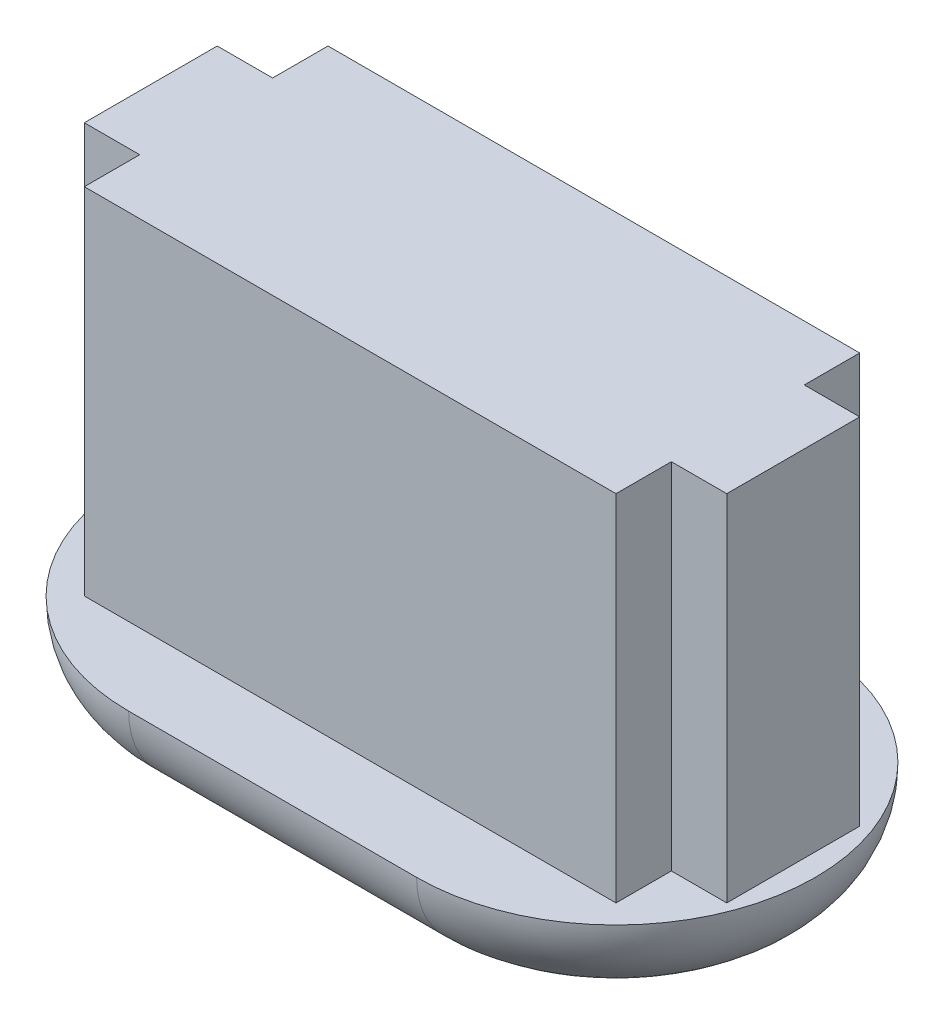
ISO-10303-21;
HEADER;
FILE_DESCRIPTION(('STEP AP214'),'2;1');
FILE_NAME('part.step','',(''),(''),'','','');
FILE_SCHEMA(('AUTOMOTIVE_DESIGN { 1 0 10303 214 1 1 1 1 }'));
ENDSEC;
DATA;
#1=APPLICATION_CONTEXT('core data for automotive mechanical design processes');
#2=APPLICATION_PROTOCOL_DEFINITION('international standard','automotive_design',2000,#1);
#3=PRODUCT_CONTEXT('',#1,'mechanical');
#4=PRODUCT('Part','Part','',(#3));
#5=PRODUCT_RELATED_PRODUCT_CATEGORY('part','',(#4));
#6=PRODUCT_DEFINITION_FORMATION('','',#4);
#7=PRODUCT_DEFINITION_CONTEXT('part definition',#1,'design');
#8=PRODUCT_DEFINITION('design','',#6,#7);
#9=PRODUCT_DEFINITION_SHAPE('','',#8);
#10=(LENGTH_UNIT() NAMED_UNIT(*) SI_UNIT(.MILLI.,.METRE.));
#11=(NAMED_UNIT(*) PLANE_ANGLE_UNIT() SI_UNIT($,.RADIAN.));
#12=(NAMED_UNIT(*) SI_UNIT($,.STERADIAN.) SOLID_ANGLE_UNIT());
#13=UNCERTAINTY_MEASURE_WITH_UNIT(LENGTH_MEASURE(1.E-05),#10,'distance_accuracy_value','');
#14=(GEOMETRIC_REPRESENTATION_CONTEXT(3) GLOBAL_UNCERTAINTY_ASSIGNED_CONTEXT((#13)) GLOBAL_UNIT_ASSIGNED_CONTEXT((#10,
#11,#12)) REPRESENTATION_CONTEXT('',''));
#15=CARTESIAN_POINT('',(0.,0.,0.));
#16=DIRECTION('',(0.,0.,1.));
#17=DIRECTION('',(1.,0.,0.));
#18=AXIS2_PLACEMENT_3D('',#15,#16,#17);
#19=CARTESIAN_POINT('',(0.,2.,0.));
#20=DIRECTION('',(0.,1.,0.));
#21=DIRECTION('',(0.,0.,1.));
#22=AXIS2_PLACEMENT_3D('',#19,#20,#21);
#23=PLANE('',#22);
#24=DIRECTION('',(1.,0.,0.));
#25=VECTOR('',#24,1.);
#26=CARTESIAN_POINT('',(0.,2.,-2.75));
#27=LINE('',#26,#25);
#28=CARTESIAN_POINT('',(-2.75,2.,-2.75));
#29=VERTEX_POINT('',#28);
#30=CARTESIAN_POINT('',(9.25,2.,-2.75));
#31=VERTEX_POINT('',#30);
#32=EDGE_CURVE('E217',#29,#31,#27,.T.);
#33=ORIENTED_EDGE('',*,*,#32,.T.);
#34=DIRECTION('',(0.,0.,-1.));
#35=VECTOR('',#34,1.);
#36=CARTESIAN_POINT('',(9.25,2.,0.));
#37=LINE('',#36,#35);
#38=CARTESIAN_POINT('',(9.25,2.,-1.5));
#39=VERTEX_POINT('',#38);
#40=EDGE_CURVE('E225',#39,#31,#37,.T.);
#41=ORIENTED_EDGE('',*,*,#40,.F.);
#42=DIRECTION('',(-1.,0.,0.));
#43=VECTOR('',#42,1.);
#44=CARTESIAN_POINT('',(0.,2.,-1.5));
#45=LINE('',#44,#43);
#46=CARTESIAN_POINT('',(10.5,2.,-1.5));
#47=VERTEX_POINT('',#46);
#48=EDGE_CURVE('E274',#47,#39,#45,.T.);
#49=ORIENTED_EDGE('',*,*,#48,.F.);
#50=DIRECTION('',(0.,0.,-1.));
#51=VECTOR('',#50,1.);
#52=CARTESIAN_POINT('',(10.5,2.,0.));
#53=LINE('',#52,#51);
#54=CARTESIAN_POINT('',(10.5,2.,1.5));
#55=VERTEX_POINT('',#54);
#56=EDGE_CURVE('E272',#55,#47,#53,.T.);
#57=ORIENTED_EDGE('',*,*,#56,.F.);
#58=DIRECTION('',(-1.,0.,0.));
#59=VECTOR('',#58,1.);
#60=CARTESIAN_POINT('',(0.,2.,1.50000000000001));
#61=LINE('',#60,#59);
#62=CARTESIAN_POINT('',(9.25,2.,1.5));
#63=VERTEX_POINT('',#62);
#64=EDGE_CURVE('E269',#55,#63,#61,.T.);
#65=ORIENTED_EDGE('',*,*,#64,.T.);
#66=CARTESIAN_POINT('',(9.25,2.,2.75));
#67=VERTEX_POINT('',#66);
#68=EDGE_CURVE('E266',#67,#63,#37,.T.);
#69=ORIENTED_EDGE('',*,*,#68,.F.);
#70=DIRECTION('',(1.,0.,0.));
#71=VECTOR('',#70,1.);
#72=CARTESIAN_POINT('',(0.,2.,2.75));
#73=LINE('',#72,#71);
#74=CARTESIAN_POINT('',(-2.75,2.,2.75));
#75=VERTEX_POINT('',#74);
#76=EDGE_CURVE('E264',#75,#67,#73,.T.);
#77=ORIENTED_EDGE('',*,*,#76,.F.);
#78=DIRECTION('',(0.,0.,-1.));
#79=VECTOR('',#78,1.);
#80=CARTESIAN_POINT('',(-2.75,2.,0.));
#81=LINE('',#80,#79);
#82=CARTESIAN_POINT('',(-2.75,2.,1.5));
#83=VERTEX_POINT('',#82);
#84=EDGE_CURVE('E255',#75,#83,#81,.T.);
#85=ORIENTED_EDGE('',*,*,#84,.T.);
#86=DIRECTION('',(1.,0.,0.));
#87=VECTOR('',#86,1.);
#88=CARTESIAN_POINT('',(0.,2.,1.5));
#89=LINE('',#88,#87);
#90=CARTESIAN_POINT('',(-4.,2.,1.5));
#91=VERTEX_POINT('',#90);
#92=EDGE_CURVE('E261',#91,#83,#89,.T.);
#93=ORIENTED_EDGE('',*,*,#92,.F.);
#94=DIRECTION('',(0.,0.,-1.));
#95=VECTOR('',#94,1.);
#96=CARTESIAN_POINT('',(-4.,2.,0.));
#97=LINE('',#96,#95);
#98=CARTESIAN_POINT('',(-4.,2.,-1.5));
#99=VERTEX_POINT('',#98);
#100=EDGE_CURVE('E258',#91,#99,#97,.T.);
#101=ORIENTED_EDGE('',*,*,#100,.T.);
#102=DIRECTION('',(1.,0.,0.));
#103=VECTOR('',#102,1.);
#104=CARTESIAN_POINT('',(0.,2.,-1.5));
#105=LINE('',#104,#103);
#106=CARTESIAN_POINT('',(-2.75,2.,-1.5));
#107=VERTEX_POINT('',#106);
#108=EDGE_CURVE('E254',#99,#107,#105,.T.);
#109=ORIENTED_EDGE('',*,*,#108,.T.);
#110=EDGE_CURVE('E251',#107,#29,#81,.T.);
#111=ORIENTED_EDGE('',*,*,#110,.T.);
#112=EDGE_LOOP('',(#33,#41,#49,#57,#65,#69,#77,#85,#93,#101,#109,#111));
#113=FACE_BOUND('',#112,.T.);
#114=CARTESIAN_POINT('',(0.,2.,0.));
#115=DIRECTION('',(0.,1.,0.));
#116=DIRECTION('',(0.,0.,1.));
#117=AXIS2_PLACEMENT_3D('',#114,#115,#116);
#118=CIRCLE('',#117,4.5);
#119=CARTESIAN_POINT('',(0.,2.,-4.5));
#120=VERTEX_POINT('',#119);
#121=CARTESIAN_POINT('',(0.,2.,4.5));
#122=VERTEX_POINT('',#121);
#123=EDGE_CURVE('E302',#120,#122,#118,.T.);
#124=ORIENTED_EDGE('',*,*,#123,.T.);
#125=DIRECTION('',(1.,0.,0.));
#126=VECTOR('',#125,1.);
#127=CARTESIAN_POINT('',(0.,2.,4.5));
#128=LINE('',#127,#126);
#129=CARTESIAN_POINT('',(6.5,2.,4.5));
#130=VERTEX_POINT('',#129);
#131=EDGE_CURVE('E304',#122,#130,#128,.T.);
#132=ORIENTED_EDGE('',*,*,#131,.T.);
#133=CARTESIAN_POINT('',(6.5,2.,0.));
#134=DIRECTION('',(0.,1.,0.));
#135=DIRECTION('',(0.,0.,1.));
#136=AXIS2_PLACEMENT_3D('',#133,#134,#135);
#137=CIRCLE('',#136,4.5);
#138=CARTESIAN_POINT('',(6.5,2.,-4.5));
#139=VERTEX_POINT('',#138);
#140=EDGE_CURVE('E306',#130,#139,#137,.T.);
#141=ORIENTED_EDGE('',*,*,#140,.T.);
#142=DIRECTION('',(-1.,0.,0.));
#143=VECTOR('',#142,1.);
#144=CARTESIAN_POINT('',(0.,2.,-4.5));
#145=LINE('',#144,#143);
#146=EDGE_CURVE('E308',#139,#120,#145,.T.);
#147=ORIENTED_EDGE('',*,*,#146,.T.);
#148=EDGE_LOOP('',(#124,#132,#141,#147));
#149=FACE_BOUND('',#148,.T.);
#150=ADVANCED_FACE('F41',(#113,#149),#23,.T.);
#151=CARTESIAN_POINT('',(0.,0.,0.));
#152=DIRECTION('',(0.,1.,0.));
#153=DIRECTION('',(0.,0.,1.));
#154=AXIS2_PLACEMENT_3D('',#151,#152,#153);
#155=PLANE('',#154);
#156=DIRECTION('',(-1.,0.,0.));
#157=VECTOR('',#156,1.);
#158=CARTESIAN_POINT('',(6.5,0.,1.5));
#159=LINE('',#158,#157);
#160=CARTESIAN_POINT('',(6.5,0.,1.5));
#161=VERTEX_POINT('',#160);
#162=CARTESIAN_POINT('',(0.,0.,1.5));
#163=VERTEX_POINT('',#162);
#164=EDGE_CURVE('E211',#161,#163,#159,.T.);
#165=ORIENTED_EDGE('',*,*,#164,.F.);
#166=CARTESIAN_POINT('',(6.5,0.,0.));
#167=DIRECTION('',(0.,-1.,0.));
#168=DIRECTION('',(0.,0.,-1.));
#169=AXIS2_PLACEMENT_3D('',#166,#167,#168);
#170=CIRCLE('',#169,1.5);
#171=CARTESIAN_POINT('',(6.5,0.,-1.5));
#172=VERTEX_POINT('',#171);
#173=EDGE_CURVE('E58',#172,#161,#170,.T.);
#174=ORIENTED_EDGE('',*,*,#173,.F.);
#175=DIRECTION('',(1.,0.,0.));
#176=VECTOR('',#175,1.);
#177=CARTESIAN_POINT('',(0.,0.,-1.5));
#178=LINE('',#177,#176);
#179=CARTESIAN_POINT('',(0.,0.,-1.5));
#180=VERTEX_POINT('',#179);
#181=EDGE_CURVE('E202',#180,#172,#178,.T.);
#182=ORIENTED_EDGE('',*,*,#181,.F.);
#183=CARTESIAN_POINT('',(0.,0.,0.));
#184=DIRECTION('',(0.,-1.,0.));
#185=DIRECTION('',(0.,0.,-1.));
#186=AXIS2_PLACEMENT_3D('',#183,#184,#185);
#187=CIRCLE('',#186,1.5);
#188=EDGE_CURVE('E205',#163,#180,#187,.T.);
#189=ORIENTED_EDGE('',*,*,#188,.F.);
#190=EDGE_LOOP('',(#165,#174,#182,#189));
#191=FACE_BOUND('',#190,.T.);
#192=CARTESIAN_POINT('',(0.,0.,0.));
#193=DIRECTION('',(0.,1.,0.));
#194=DIRECTION('',(0.,0.,1.));
#195=AXIS2_PLACEMENT_3D('',#192,#193,#194);
#196=CIRCLE('',#195,2.5);
#197=CARTESIAN_POINT('',(0.,0.,2.5));
#198=VERTEX_POINT('',#197);
#199=CARTESIAN_POINT('',(0.,0.,-2.5));
#200=VERTEX_POINT('',#199);
#201=EDGE_CURVE('E313',#198,#200,#196,.F.);
#202=ORIENTED_EDGE('',*,*,#201,.T.);
#203=DIRECTION('',(-1.,0.,0.));
#204=VECTOR('',#203,1.);
#205=CARTESIAN_POINT('',(0.,0.,-2.5));
#206=LINE('',#205,#204);
#207=CARTESIAN_POINT('',(6.5,0.,-2.5));
#208=VERTEX_POINT('',#207);
#209=EDGE_CURVE('E11',#200,#208,#206,.F.);
#210=ORIENTED_EDGE('',*,*,#209,.T.);
#211=CARTESIAN_POINT('',(6.5,0.,0.));
#212=DIRECTION('',(0.,1.,0.));
#213=DIRECTION('',(0.,0.,1.));
#214=AXIS2_PLACEMENT_3D('',#211,#212,#213);
#215=CIRCLE('',#214,2.5);
#216=CARTESIAN_POINT('',(6.5,0.,2.5));
#217=VERTEX_POINT('',#216);
#218=EDGE_CURVE('E50',#208,#217,#215,.F.);
#219=ORIENTED_EDGE('',*,*,#218,.T.);
#220=DIRECTION('',(1.,0.,0.));
#221=VECTOR('',#220,1.);
#222=CARTESIAN_POINT('',(0.,0.,2.5));
#223=LINE('',#222,#221);
#224=EDGE_CURVE('E311',#217,#198,#223,.F.);
#225=ORIENTED_EDGE('',*,*,#224,.T.);
#226=EDGE_LOOP('',(#202,#210,#219,#225));
#227=FACE_BOUND('',#226,.T.);
#228=ADVANCED_FACE('F335',(#191,#227),#155,.F.);
#229=CARTESIAN_POINT('',(0.,2.,2.5));
#230=DIRECTION('',(1.,0.,0.));
#231=DIRECTION('',(0.,0.,-1.));
#232=AXIS2_PLACEMENT_3D('',#229,#230,#231);
#233=CYLINDRICAL_SURFACE('',#232,2.);
#234=CARTESIAN_POINT('',(0.,2.,2.5));
#235=DIRECTION('',(-1.,0.,0.));
#236=DIRECTION('',(0.,0.,1.));
#237=AXIS2_PLACEMENT_3D('',#234,#235,#236);
#238=CIRCLE('',#237,2.);
#239=EDGE_CURVE('E318',#198,#122,#238,.T.);
#240=ORIENTED_EDGE('',*,*,#239,.F.);
#241=ORIENTED_EDGE('',*,*,#224,.F.);
#242=CARTESIAN_POINT('',(6.5,2.,2.5));
#243=DIRECTION('',(1.,0.,0.));
#244=DIRECTION('',(0.,0.,-1.));
#245=AXIS2_PLACEMENT_3D('',#242,#243,#244);
#246=CIRCLE('',#245,2.);
#247=EDGE_CURVE('E45',#130,#217,#246,.T.);
#248=ORIENTED_EDGE('',*,*,#247,.F.);
#249=ORIENTED_EDGE('',*,*,#131,.F.);
#250=EDGE_LOOP('',(#240,#241,#248,#249));
#251=FACE_BOUND('',#250,.T.);
#252=ADVANCED_FACE('F43',(#251),#233,.T.);
#253=CARTESIAN_POINT('',(6.5,2.,0.));
#254=DIRECTION('',(0.,1.,0.));
#255=DIRECTION('',(0.,0.,1.));
#256=AXIS2_PLACEMENT_3D('',#253,#254,#255);
#257=TOROIDAL_SURFACE('',#256,2.5,2.);
#258=ORIENTED_EDGE('',*,*,#247,.T.);
#259=ORIENTED_EDGE('',*,*,#218,.F.);
#260=CARTESIAN_POINT('',(6.5,2.,-2.5));
#261=DIRECTION('',(-1.,0.,0.));
#262=DIRECTION('',(0.,0.,1.));
#263=AXIS2_PLACEMENT_3D('',#260,#261,#262);
#264=CIRCLE('',#263,2.);
#265=EDGE_CURVE('E317',#139,#208,#264,.T.);
#266=ORIENTED_EDGE('',*,*,#265,.F.);
#267=ORIENTED_EDGE('',*,*,#140,.F.);
#268=EDGE_LOOP('',(#258,#259,#266,#267));
#269=FACE_BOUND('',#268,.T.);
#270=ADVANCED_FACE('F329',(#269),#257,.T.);
#271=CARTESIAN_POINT('',(0.,2.,0.));
#272=DIRECTION('',(0.,1.,0.));
#273=DIRECTION('',(0.,0.,1.));
#274=AXIS2_PLACEMENT_3D('',#271,#272,#273);
#275=TOROIDAL_SURFACE('',#274,2.5,2.);
#276=ORIENTED_EDGE('',*,*,#239,.T.);
#277=ORIENTED_EDGE('',*,*,#123,.F.);
#278=CARTESIAN_POINT('',(0.,2.,-2.5));
#279=DIRECTION('',(1.,0.,0.));
#280=DIRECTION('',(0.,0.,-1.));
#281=AXIS2_PLACEMENT_3D('',#278,#279,#280);
#282=CIRCLE('',#281,2.);
#283=EDGE_CURVE('E301',#200,#120,#282,.T.);
#284=ORIENTED_EDGE('',*,*,#283,.F.);
#285=ORIENTED_EDGE('',*,*,#201,.F.);
#286=EDGE_LOOP('',(#276,#277,#284,#285));
#287=FACE_BOUND('',#286,.T.);
#288=ADVANCED_FACE('F341',(#287),#275,.T.);
#289=CARTESIAN_POINT('',(0.,2.,-2.5));
#290=DIRECTION('',(-1.,0.,0.));
#291=DIRECTION('',(0.,0.,1.));
#292=AXIS2_PLACEMENT_3D('',#289,#290,#291);
#293=CYLINDRICAL_SURFACE('',#292,2.);
#294=ORIENTED_EDGE('',*,*,#265,.T.);
#295=ORIENTED_EDGE('',*,*,#209,.F.);
#296=ORIENTED_EDGE('',*,*,#283,.T.);
#297=ORIENTED_EDGE('',*,*,#146,.F.);
#298=EDGE_LOOP('',(#294,#295,#296,#297));
#299=FACE_BOUND('',#298,.T.);
#300=ADVANCED_FACE('F339',(#299),#293,.T.);
#301=CARTESIAN_POINT('',(0.,10.,-2.75));
#302=DIRECTION('',(0.,0.,-1.));
#303=DIRECTION('',(-1.,0.,0.));
#304=AXIS2_PLACEMENT_3D('',#301,#302,#303);
#305=PLANE('',#304);
#306=ORIENTED_EDGE('',*,*,#32,.F.);
#307=DIRECTION('',(0.,-1.,0.));
#308=VECTOR('',#307,1.);
#309=CARTESIAN_POINT('',(-2.75,10.,-2.75));
#310=LINE('',#309,#308);
#311=CARTESIAN_POINT('',(-2.75,10.,-2.75));
#312=VERTEX_POINT('',#311);
#313=EDGE_CURVE('E299',#312,#29,#310,.T.);
#314=ORIENTED_EDGE('',*,*,#313,.F.);
#315=DIRECTION('',(1.,0.,0.));
#316=VECTOR('',#315,1.);
#317=CARTESIAN_POINT('',(0.,10.,-2.75));
#318=LINE('',#317,#316);
#319=CARTESIAN_POINT('',(9.25,10.,-2.75));
#320=VERTEX_POINT('',#319);
#321=EDGE_CURVE('E221',#312,#320,#318,.T.);
#322=ORIENTED_EDGE('',*,*,#321,.T.);
#323=DIRECTION('',(0.,-1.,0.));
#324=VECTOR('',#323,1.);
#325=CARTESIAN_POINT('',(9.25,10.,-2.75));
#326=LINE('',#325,#324);
#327=EDGE_CURVE('E276',#320,#31,#326,.T.);
#328=ORIENTED_EDGE('',*,*,#327,.T.);
#329=EDGE_LOOP('',(#306,#314,#322,#328));
#330=FACE_BOUND('',#329,.T.);
#331=ADVANCED_FACE('F354',(#330),#305,.T.);
#332=CARTESIAN_POINT('',(-2.75,10.,0.));
#333=DIRECTION('',(-1.,0.,0.));
#334=DIRECTION('',(0.,0.,1.));
#335=AXIS2_PLACEMENT_3D('',#332,#333,#334);
#336=PLANE('',#335);
#337=ORIENTED_EDGE('',*,*,#110,.F.);
#338=DIRECTION('',(0.,-1.,0.));
#339=VECTOR('',#338,1.);
#340=CARTESIAN_POINT('',(-2.75,10.,-1.5));
#341=LINE('',#340,#339);
#342=CARTESIAN_POINT('',(-2.75,10.,-1.5));
#343=VERTEX_POINT('',#342);
#344=EDGE_CURVE('E297',#343,#107,#341,.T.);
#345=ORIENTED_EDGE('',*,*,#344,.F.);
#346=DIRECTION('',(0.,0.,-1.));
#347=VECTOR('',#346,1.);
#348=CARTESIAN_POINT('',(-2.75,10.,0.));
#349=LINE('',#348,#347);
#350=EDGE_CURVE('E224',#343,#312,#349,.T.);
#351=ORIENTED_EDGE('',*,*,#350,.T.);
#352=ORIENTED_EDGE('',*,*,#313,.T.);
#353=EDGE_LOOP('',(#337,#345,#351,#352));
#354=FACE_BOUND('',#353,.T.);
#355=ADVANCED_FACE('F384',(#354),#336,.T.);
#356=CARTESIAN_POINT('',(0.,10.,-1.5));
#357=DIRECTION('',(0.,0.,-1.));
#358=DIRECTION('',(-1.,0.,0.));
#359=AXIS2_PLACEMENT_3D('',#356,#357,#358);
#360=PLANE('',#359);
#361=ORIENTED_EDGE('',*,*,#108,.F.);
#362=DIRECTION('',(0.,-1.,0.));
#363=VECTOR('',#362,1.);
#364=CARTESIAN_POINT('',(-4.,10.,-1.5));
#365=LINE('',#364,#363);
#366=CARTESIAN_POINT('',(-4.,10.,-1.5));
#367=VERTEX_POINT('',#366);
#368=EDGE_CURVE('E295',#367,#99,#365,.T.);
#369=ORIENTED_EDGE('',*,*,#368,.F.);
#370=DIRECTION('',(1.,0.,0.));
#371=VECTOR('',#370,1.);
#372=CARTESIAN_POINT('',(0.,10.,-1.5));
#373=LINE('',#372,#371);
#374=EDGE_CURVE('E228',#367,#343,#373,.T.);
#375=ORIENTED_EDGE('',*,*,#374,.T.);
#376=ORIENTED_EDGE('',*,*,#344,.T.);
#377=EDGE_LOOP('',(#361,#369,#375,#376));
#378=FACE_BOUND('',#377,.T.);
#379=ADVANCED_FACE('F391',(#378),#360,.T.);
#380=CARTESIAN_POINT('',(-4.,10.,0.));
#381=DIRECTION('',(-1.,0.,0.));
#382=DIRECTION('',(0.,0.,1.));
#383=AXIS2_PLACEMENT_3D('',#380,#381,#382);
#384=PLANE('',#383);
#385=ORIENTED_EDGE('',*,*,#100,.F.);
#386=DIRECTION('',(0.,-1.,0.));
#387=VECTOR('',#386,1.);
#388=CARTESIAN_POINT('',(-4.,10.,1.5));
#389=LINE('',#388,#387);
#390=CARTESIAN_POINT('',(-4.,10.,1.5));
#391=VERTEX_POINT('',#390);
#392=EDGE_CURVE('E293',#391,#91,#389,.T.);
#393=ORIENTED_EDGE('',*,*,#392,.F.);
#394=DIRECTION('',(0.,0.,-1.));
#395=VECTOR('',#394,1.);
#396=CARTESIAN_POINT('',(-4.,10.,0.));
#397=LINE('',#396,#395);
#398=EDGE_CURVE('E232',#391,#367,#397,.T.);
#399=ORIENTED_EDGE('',*,*,#398,.T.);
#400=ORIENTED_EDGE('',*,*,#368,.T.);
#401=EDGE_LOOP('',(#385,#393,#399,#400));
#402=FACE_BOUND('',#401,.T.);
#403=ADVANCED_FACE('F403',(#402),#384,.T.);
#404=CARTESIAN_POINT('',(0.,10.,1.5));
#405=DIRECTION('',(0.,0.,-1.));
#406=DIRECTION('',(-1.,0.,0.));
#407=AXIS2_PLACEMENT_3D('',#404,#405,#406);
#408=PLANE('',#407);
#409=ORIENTED_EDGE('',*,*,#92,.T.);
#410=DIRECTION('',(0.,-1.,0.));
#411=VECTOR('',#410,1.);
#412=CARTESIAN_POINT('',(-2.75,10.,1.5));
#413=LINE('',#412,#411);
#414=CARTESIAN_POINT('',(-2.75,10.,1.5));
#415=VERTEX_POINT('',#414);
#416=EDGE_CURVE('E291',#415,#83,#413,.T.);
#417=ORIENTED_EDGE('',*,*,#416,.F.);
#418=DIRECTION('',(1.,0.,0.));
#419=VECTOR('',#418,1.);
#420=CARTESIAN_POINT('',(0.,10.,1.5));
#421=LINE('',#420,#419);
#422=EDGE_CURVE('E235',#391,#415,#421,.T.);
#423=ORIENTED_EDGE('',*,*,#422,.F.);
#424=ORIENTED_EDGE('',*,*,#392,.T.);
#425=EDGE_LOOP('',(#409,#417,#423,#424));
#426=FACE_BOUND('',#425,.T.);
#427=ADVANCED_FACE('F410',(#426),#408,.F.);
#428=ORIENTED_EDGE('',*,*,#84,.F.);
#429=DIRECTION('',(0.,-1.,0.));
#430=VECTOR('',#429,1.);
#431=CARTESIAN_POINT('',(-2.75,10.,2.75));
#432=LINE('',#431,#430);
#433=CARTESIAN_POINT('',(-2.75,10.,2.75));
#434=VERTEX_POINT('',#433);
#435=EDGE_CURVE('E289',#434,#75,#432,.T.);
#436=ORIENTED_EDGE('',*,*,#435,.F.);
#437=EDGE_CURVE('E229',#434,#415,#349,.T.);
#438=ORIENTED_EDGE('',*,*,#437,.T.);
#439=ORIENTED_EDGE('',*,*,#416,.T.);
#440=EDGE_LOOP('',(#428,#436,#438,#439));
#441=FACE_BOUND('',#440,.T.);
#442=ADVANCED_FACE('F394',(#441),#336,.T.);
#443=CARTESIAN_POINT('',(0.,10.,2.75));
#444=DIRECTION('',(0.,0.,-1.));
#445=DIRECTION('',(-1.,0.,0.));
#446=AXIS2_PLACEMENT_3D('',#443,#444,#445);
#447=PLANE('',#446);
#448=ORIENTED_EDGE('',*,*,#76,.T.);
#449=DIRECTION('',(0.,-1.,0.));
#450=VECTOR('',#449,1.);
#451=CARTESIAN_POINT('',(9.25,10.,2.75));
#452=LINE('',#451,#450);
#453=CARTESIAN_POINT('',(9.25,10.,2.75));
#454=VERTEX_POINT('',#453);
#455=EDGE_CURVE('E286',#454,#67,#452,.T.);
#456=ORIENTED_EDGE('',*,*,#455,.F.);
#457=DIRECTION('',(1.,0.,0.));
#458=VECTOR('',#457,1.);
#459=CARTESIAN_POINT('',(0.,10.,2.75));
#460=LINE('',#459,#458);
#461=EDGE_CURVE('E237',#434,#454,#460,.T.);
#462=ORIENTED_EDGE('',*,*,#461,.F.);
#463=ORIENTED_EDGE('',*,*,#435,.T.);
#464=EDGE_LOOP('',(#448,#456,#462,#463));
#465=FACE_BOUND('',#464,.T.);
#466=ADVANCED_FACE('F425',(#465),#447,.F.);
#467=CARTESIAN_POINT('',(9.25,10.,0.));
#468=DIRECTION('',(-1.,0.,0.));
#469=DIRECTION('',(0.,0.,1.));
#470=AXIS2_PLACEMENT_3D('',#467,#468,#469);
#471=PLANE('',#470);
#472=ORIENTED_EDGE('',*,*,#68,.T.);
#473=DIRECTION('',(0.,-1.,0.));
#474=VECTOR('',#473,1.);
#475=CARTESIAN_POINT('',(9.25,10.,1.5));
#476=LINE('',#475,#474);
#477=CARTESIAN_POINT('',(9.25,10.,1.5));
#478=VERTEX_POINT('',#477);
#479=EDGE_CURVE('E284',#478,#63,#476,.T.);
#480=ORIENTED_EDGE('',*,*,#479,.F.);
#481=DIRECTION('',(0.,0.,-1.));
#482=VECTOR('',#481,1.);
#483=CARTESIAN_POINT('',(9.25,10.,0.));
#484=LINE('',#483,#482);
#485=EDGE_CURVE('E239',#454,#478,#484,.T.);
#486=ORIENTED_EDGE('',*,*,#485,.F.);
#487=ORIENTED_EDGE('',*,*,#455,.T.);
#488=EDGE_LOOP('',(#472,#480,#486,#487));
#489=FACE_BOUND('',#488,.T.);
#490=ADVANCED_FACE('F435',(#489),#471,.F.);
#491=CARTESIAN_POINT('',(0.,10.,1.50000000000001));
#492=DIRECTION('',(0.,0.,1.));
#493=DIRECTION('',(1.,0.,0.));
#494=AXIS2_PLACEMENT_3D('',#491,#492,#493);
#495=PLANE('',#494);
#496=ORIENTED_EDGE('',*,*,#64,.F.);
#497=DIRECTION('',(0.,-1.,0.));
#498=VECTOR('',#497,1.);
#499=CARTESIAN_POINT('',(10.5,10.,1.5));
#500=LINE('',#499,#498);
#501=CARTESIAN_POINT('',(10.5,10.,1.5));
#502=VERTEX_POINT('',#501);
#503=EDGE_CURVE('E282',#502,#55,#500,.T.);
#504=ORIENTED_EDGE('',*,*,#503,.F.);
#505=DIRECTION('',(-1.,0.,0.));
#506=VECTOR('',#505,1.);
#507=CARTESIAN_POINT('',(0.,10.,1.50000000000001));
#508=LINE('',#507,#506);
#509=EDGE_CURVE('E241',#502,#478,#508,.T.);
#510=ORIENTED_EDGE('',*,*,#509,.T.);
#511=ORIENTED_EDGE('',*,*,#479,.T.);
#512=EDGE_LOOP('',(#496,#504,#510,#511));
#513=FACE_BOUND('',#512,.T.);
#514=ADVANCED_FACE('F443',(#513),#495,.T.);
#515=CARTESIAN_POINT('',(10.5,10.,0.));
#516=DIRECTION('',(-1.,0.,0.));
#517=DIRECTION('',(0.,0.,1.));
#518=AXIS2_PLACEMENT_3D('',#515,#516,#517);
#519=PLANE('',#518);
#520=ORIENTED_EDGE('',*,*,#56,.T.);
#521=DIRECTION('',(0.,-1.,0.));
#522=VECTOR('',#521,1.);
#523=CARTESIAN_POINT('',(10.5,10.,-1.5));
#524=LINE('',#523,#522);
#525=CARTESIAN_POINT('',(10.5,10.,-1.5));
#526=VERTEX_POINT('',#525);
#527=EDGE_CURVE('E279',#526,#47,#524,.T.);
#528=ORIENTED_EDGE('',*,*,#527,.F.);
#529=DIRECTION('',(0.,0.,-1.));
#530=VECTOR('',#529,1.);
#531=CARTESIAN_POINT('',(10.5,10.,0.));
#532=LINE('',#531,#530);
#533=EDGE_CURVE('E245',#502,#526,#532,.T.);
#534=ORIENTED_EDGE('',*,*,#533,.F.);
#535=ORIENTED_EDGE('',*,*,#503,.T.);
#536=EDGE_LOOP('',(#520,#528,#534,#535));
#537=FACE_BOUND('',#536,.T.);
#538=ADVANCED_FACE('F452',(#537),#519,.F.);
#539=CARTESIAN_POINT('',(0.,10.,-1.5));
#540=DIRECTION('',(0.,0.,1.));
#541=DIRECTION('',(1.,0.,0.));
#542=AXIS2_PLACEMENT_3D('',#539,#540,#541);
#543=PLANE('',#542);
#544=ORIENTED_EDGE('',*,*,#48,.T.);
#545=DIRECTION('',(0.,-1.,0.));
#546=VECTOR('',#545,1.);
#547=CARTESIAN_POINT('',(9.25,10.,-1.5));
#548=LINE('',#547,#546);
#549=CARTESIAN_POINT('',(9.25,10.,-1.5));
#550=VERTEX_POINT('',#549);
#551=EDGE_CURVE('E66',#550,#39,#548,.T.);
#552=ORIENTED_EDGE('',*,*,#551,.F.);
#553=DIRECTION('',(-1.,0.,0.));
#554=VECTOR('',#553,1.);
#555=CARTESIAN_POINT('',(0.,10.,-1.5));
#556=LINE('',#555,#554);
#557=EDGE_CURVE('E247',#526,#550,#556,.T.);
#558=ORIENTED_EDGE('',*,*,#557,.F.);
#559=ORIENTED_EDGE('',*,*,#527,.T.);
#560=EDGE_LOOP('',(#544,#552,#558,#559));
#561=FACE_BOUND('',#560,.T.);
#562=ADVANCED_FACE('F460',(#561),#543,.F.);
#563=ORIENTED_EDGE('',*,*,#40,.T.);
#564=ORIENTED_EDGE('',*,*,#327,.F.);
#565=EDGE_CURVE('E242',#550,#320,#484,.T.);
#566=ORIENTED_EDGE('',*,*,#565,.F.);
#567=ORIENTED_EDGE('',*,*,#551,.T.);
#568=EDGE_LOOP('',(#563,#564,#566,#567));
#569=FACE_BOUND('',#568,.T.);
#570=ADVANCED_FACE('F446',(#569),#471,.F.);
#571=CARTESIAN_POINT('',(0.,10.,0.));
#572=DIRECTION('',(0.,1.,0.));
#573=DIRECTION('',(0.,0.,1.));
#574=AXIS2_PLACEMENT_3D('',#571,#572,#573);
#575=PLANE('',#574);
#576=ORIENTED_EDGE('',*,*,#321,.F.);
#577=ORIENTED_EDGE('',*,*,#350,.F.);
#578=ORIENTED_EDGE('',*,*,#374,.F.);
#579=ORIENTED_EDGE('',*,*,#398,.F.);
#580=ORIENTED_EDGE('',*,*,#422,.T.);
#581=ORIENTED_EDGE('',*,*,#437,.F.);
#582=ORIENTED_EDGE('',*,*,#461,.T.);
#583=ORIENTED_EDGE('',*,*,#485,.T.);
#584=ORIENTED_EDGE('',*,*,#509,.F.);
#585=ORIENTED_EDGE('',*,*,#533,.T.);
#586=ORIENTED_EDGE('',*,*,#557,.T.);
#587=ORIENTED_EDGE('',*,*,#565,.T.);
#588=EDGE_LOOP('',(#576,#577,#578,#579,#580,#581,#582,#583,#584,#585,#586,#587));
#589=FACE_BOUND('',#588,.T.);
#590=ADVANCED_FACE('F475',(#589),#575,.T.);
#591=CARTESIAN_POINT('',(6.5,5.,0.));
#592=DIRECTION('',(0.,-1.,0.));
#593=DIRECTION('',(0.,0.,-1.));
#594=AXIS2_PLACEMENT_3D('',#591,#592,#593);
#595=CYLINDRICAL_SURFACE('',#594,1.5);
#596=ORIENTED_EDGE('',*,*,#173,.T.);
#597=DIRECTION('',(0.,-1.,0.));
#598=VECTOR('',#597,1.);
#599=CARTESIAN_POINT('',(6.5,5.,1.5));
#600=LINE('',#599,#598);
#601=CARTESIAN_POINT('',(6.5,5.,1.5));
#602=VERTEX_POINT('',#601);
#603=EDGE_CURVE('E180',#602,#161,#600,.T.);
#604=ORIENTED_EDGE('',*,*,#603,.F.);
#605=CARTESIAN_POINT('',(6.5,5.,0.));
#606=DIRECTION('',(0.,-1.,0.));
#607=DIRECTION('',(0.,0.,-1.));
#608=AXIS2_PLACEMENT_3D('',#605,#606,#607);
#609=CIRCLE('',#608,1.5);
#610=CARTESIAN_POINT('',(6.5,5.,-1.5));
#611=VERTEX_POINT('',#610);
#612=EDGE_CURVE('E184',#611,#602,#609,.T.);
#613=ORIENTED_EDGE('',*,*,#612,.F.);
#614=DIRECTION('',(0.,-1.,0.));
#615=VECTOR('',#614,1.);
#616=CARTESIAN_POINT('',(6.5,5.,-1.5));
#617=LINE('',#616,#615);
#618=EDGE_CURVE('E215',#611,#172,#617,.T.);
#619=ORIENTED_EDGE('',*,*,#618,.T.);
#620=EDGE_LOOP('',(#596,#604,#613,#619));
#621=FACE_BOUND('',#620,.T.);
#622=ADVANCED_FACE('F182',(#621),#595,.F.);
#623=CARTESIAN_POINT('',(0.,5.,-1.5));
#624=DIRECTION('',(0.,0.,-1.));
#625=DIRECTION('',(-1.,0.,0.));
#626=AXIS2_PLACEMENT_3D('',#623,#624,#625);
#627=PLANE('',#626);
#628=ORIENTED_EDGE('',*,*,#181,.T.);
#629=ORIENTED_EDGE('',*,*,#618,.F.);
#630=DIRECTION('',(1.,0.,0.));
#631=VECTOR('',#630,1.);
#632=CARTESIAN_POINT('',(0.,5.,-1.5));
#633=LINE('',#632,#631);
#634=CARTESIAN_POINT('',(0.,5.,-1.5));
#635=VERTEX_POINT('',#634);
#636=EDGE_CURVE('E190',#635,#611,#633,.T.);
#637=ORIENTED_EDGE('',*,*,#636,.F.);
#638=DIRECTION('',(0.,-1.,0.));
#639=VECTOR('',#638,1.);
#640=CARTESIAN_POINT('',(0.,5.,-1.5));
#641=LINE('',#640,#639);
#642=EDGE_CURVE('E218',#635,#180,#641,.T.);
#643=ORIENTED_EDGE('',*,*,#642,.T.);
#644=EDGE_LOOP('',(#628,#629,#637,#643));
#645=FACE_BOUND('',#644,.T.);
#646=ADVANCED_FACE('F497',(#645),#627,.F.);
#647=CARTESIAN_POINT('',(0.,5.,0.));
#648=DIRECTION('',(0.,-1.,0.));
#649=DIRECTION('',(0.,0.,-1.));
#650=AXIS2_PLACEMENT_3D('',#647,#648,#649);
#651=CYLINDRICAL_SURFACE('',#650,1.5);
#652=ORIENTED_EDGE('',*,*,#188,.T.);
#653=ORIENTED_EDGE('',*,*,#642,.F.);
#654=CARTESIAN_POINT('',(0.,5.,0.));
#655=DIRECTION('',(0.,-1.,0.));
#656=DIRECTION('',(0.,0.,-1.));
#657=AXIS2_PLACEMENT_3D('',#654,#655,#656);
#658=CIRCLE('',#657,1.5);
#659=CARTESIAN_POINT('',(0.,5.,1.5));
#660=VERTEX_POINT('',#659);
#661=EDGE_CURVE('E198',#660,#635,#658,.T.);
#662=ORIENTED_EDGE('',*,*,#661,.F.);
#663=DIRECTION('',(0.,-1.,0.));
#664=VECTOR('',#663,1.);
#665=CARTESIAN_POINT('',(0.,5.,1.5));
#666=LINE('',#665,#664);
#667=EDGE_CURVE('E189',#660,#163,#666,.T.);
#668=ORIENTED_EDGE('',*,*,#667,.T.);
#669=EDGE_LOOP('',(#652,#653,#662,#668));
#670=FACE_BOUND('',#669,.T.);
#671=ADVANCED_FACE('F504',(#670),#651,.F.);
#672=CARTESIAN_POINT('',(6.5,5.,1.5));
#673=DIRECTION('',(0.,0.,1.));
#674=DIRECTION('',(1.,0.,0.));
#675=AXIS2_PLACEMENT_3D('',#672,#673,#674);
#676=PLANE('',#675);
#677=ORIENTED_EDGE('',*,*,#164,.T.);
#678=ORIENTED_EDGE('',*,*,#667,.F.);
#679=DIRECTION('',(-1.,0.,0.));
#680=VECTOR('',#679,1.);
#681=CARTESIAN_POINT('',(6.5,5.,1.5));
#682=LINE('',#681,#680);
#683=EDGE_CURVE('E193',#602,#660,#682,.T.);
#684=ORIENTED_EDGE('',*,*,#683,.F.);
#685=ORIENTED_EDGE('',*,*,#603,.T.);
#686=EDGE_LOOP('',(#677,#678,#684,#685));
#687=FACE_BOUND('',#686,.T.);
#688=ADVANCED_FACE('F194',(#687),#676,.F.);
#689=CARTESIAN_POINT('',(6.5,5.,0.));
#690=DIRECTION('',(0.,-1.,0.));
#691=DIRECTION('',(0.,0.,-1.));
#692=AXIS2_PLACEMENT_3D('',#689,#690,#691);
#693=PLANE('',#692);
#694=ORIENTED_EDGE('',*,*,#612,.T.);
#695=ORIENTED_EDGE('',*,*,#683,.T.);
#696=ORIENTED_EDGE('',*,*,#661,.T.);
#697=ORIENTED_EDGE('',*,*,#636,.T.);
#698=EDGE_LOOP('',(#694,#695,#696,#697));
#699=FACE_BOUND('',#698,.T.);
#700=ADVANCED_FACE('F200',(#699),#693,.T.);
#701=CLOSED_SHELL('',(#150,#228,#252,#270,#288,#300,#331,#355,#379,#403,#427,#442,#466,#490,
#514,#538,#562,#570,#590,#622,#646,#671,#688,#700));
#702=MANIFOLD_SOLID_BREP('B2',#701);
#703=ADVANCED_BREP_SHAPE_REPRESENTATION('',(#18,#702),#14);
#704=SHAPE_DEFINITION_REPRESENTATION(#9,#703);
ENDSEC;
END-ISO-10303-21;
